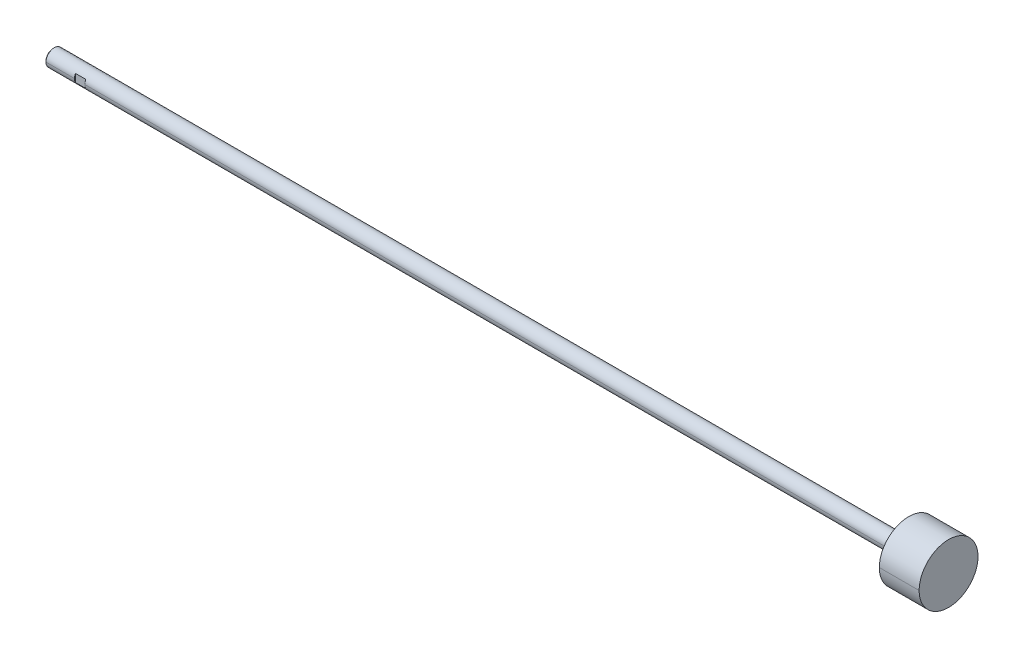
ISO-10303-21;
HEADER;
FILE_DESCRIPTION(('STEP AP214'),'2;1');
FILE_NAME('part.step','',(''),(''),'','','');
FILE_SCHEMA(('AUTOMOTIVE_DESIGN { 1 0 10303 214 1 1 1 1 }'));
ENDSEC;
DATA;
#1=APPLICATION_CONTEXT('core data for automotive mechanical design processes');
#2=APPLICATION_PROTOCOL_DEFINITION('international standard','automotive_design',2000,#1);
#3=PRODUCT_CONTEXT('',#1,'mechanical');
#4=PRODUCT('Part','Part','',(#3));
#5=PRODUCT_RELATED_PRODUCT_CATEGORY('part','',(#4));
#6=PRODUCT_DEFINITION_FORMATION('','',#4);
#7=PRODUCT_DEFINITION_CONTEXT('part definition',#1,'design');
#8=PRODUCT_DEFINITION('design','',#6,#7);
#9=PRODUCT_DEFINITION_SHAPE('','',#8);
#10=(LENGTH_UNIT() NAMED_UNIT(*) SI_UNIT(.MILLI.,.METRE.));
#11=(NAMED_UNIT(*) PLANE_ANGLE_UNIT() SI_UNIT($,.RADIAN.));
#12=(NAMED_UNIT(*) SI_UNIT($,.STERADIAN.) SOLID_ANGLE_UNIT());
#13=UNCERTAINTY_MEASURE_WITH_UNIT(LENGTH_MEASURE(1.E-05),#10,'distance_accuracy_value','');
#14=(GEOMETRIC_REPRESENTATION_CONTEXT(3) GLOBAL_UNCERTAINTY_ASSIGNED_CONTEXT((#13)) GLOBAL_UNIT_ASSIGNED_CONTEXT((#10,
#11,#12)) REPRESENTATION_CONTEXT('',''));
#15=CARTESIAN_POINT('',(0.,0.,0.));
#16=DIRECTION('',(0.,0.,1.));
#17=DIRECTION('',(1.,0.,0.));
#18=AXIS2_PLACEMENT_3D('',#15,#16,#17);
#19=CARTESIAN_POINT('',(0.,-6.35,-5.588));
#20=DIRECTION('',(0.,0.,1.));
#21=DIRECTION('',(1.,0.,0.));
#22=AXIS2_PLACEMENT_3D('',#19,#20,#21);
#23=PLANE('',#22);
#24=DIRECTION('',(0.,1.,0.));
#25=VECTOR('',#24,1.);
#26=CARTESIAN_POINT('',(-7.874,-6.35,-5.588));
#27=LINE('',#26,#25);
#28=CARTESIAN_POINT('',(-7.87400000000005,-3.01608289010763,-5.588));
#29=VERTEX_POINT('',#28);
#30=CARTESIAN_POINT('',(-7.87400000000005,3.01608289010763,-5.588));
#31=VERTEX_POINT('',#30);
#32=EDGE_CURVE('E11',#29,#31,#27,.T.);
#33=ORIENTED_EDGE('',*,*,#32,.T.);
#34=DIRECTION('',(1.,0.,0.));
#35=VECTOR('',#34,1.);
#36=CARTESIAN_POINT('',(649.351,3.01608289010763,-5.588));
#37=LINE('',#36,#35);
#38=CARTESIAN_POINT('',(0.,3.01608289010763,-5.588));
#39=VERTEX_POINT('',#38);
#40=EDGE_CURVE('E24',#31,#39,#37,.T.);
#41=ORIENTED_EDGE('',*,*,#40,.T.);
#42=DIRECTION('',(0.,1.,0.));
#43=VECTOR('',#42,1.);
#44=CARTESIAN_POINT('',(0.,-6.35,-5.588));
#45=LINE('',#44,#43);
#46=CARTESIAN_POINT('',(0.,-3.01608289010763,-5.588));
#47=VERTEX_POINT('',#46);
#48=EDGE_CURVE('E245',#47,#39,#45,.T.);
#49=ORIENTED_EDGE('',*,*,#48,.F.);
#50=DIRECTION('',(1.,0.,0.));
#51=VECTOR('',#50,1.);
#52=CARTESIAN_POINT('',(649.351,-3.01608289010763,-5.588));
#53=LINE('',#52,#51);
#54=EDGE_CURVE('E240',#29,#47,#53,.T.);
#55=ORIENTED_EDGE('',*,*,#54,.F.);
#56=EDGE_LOOP('',(#33,#41,#49,#55));
#57=FACE_BOUND('',#56,.T.);
#58=ADVANCED_FACE('F16',(#57),#23,.F.);
#59=CARTESIAN_POINT('',(649.351,0.,0.));
#60=DIRECTION('',(-1.,0.,0.));
#61=DIRECTION('',(0.,1.,0.));
#62=AXIS2_PLACEMENT_3D('',#59,#60,#61);
#63=CYLINDRICAL_SURFACE('',#62,6.35);
#64=CARTESIAN_POINT('',(-29.47035,0.,0.));
#65=DIRECTION('',(1.,0.,0.));
#66=DIRECTION('',(0.,0.,-1.));
#67=AXIS2_PLACEMENT_3D('',#64,#65,#66);
#68=CIRCLE('',#67,6.35);
#69=CARTESIAN_POINT('',(-29.4703500000001,0.,6.35));
#70=VERTEX_POINT('',#69);
#71=CARTESIAN_POINT('',(-29.47035,0.,-6.35));
#72=VERTEX_POINT('',#71);
#73=EDGE_CURVE('E236',#70,#72,#68,.T.);
#74=ORIENTED_EDGE('',*,*,#73,.T.);
#75=DIRECTION('',(-1.,0.,0.));
#76=VECTOR('',#75,1.);
#77=CARTESIAN_POINT('',(-7.87400000000002,0.,-6.35));
#78=LINE('',#77,#76);
#79=CARTESIAN_POINT('',(-7.87400000000002,0.,-6.35));
#80=VERTEX_POINT('',#79);
#81=EDGE_CURVE('E231',#80,#72,#78,.T.);
#82=ORIENTED_EDGE('',*,*,#81,.F.);
#83=CARTESIAN_POINT('',(-7.87400000000005,0.,0.));
#84=DIRECTION('',(1.,0.,0.));
#85=DIRECTION('',(0.,0.,-1.));
#86=AXIS2_PLACEMENT_3D('',#83,#84,#85);
#87=CIRCLE('',#86,6.35);
#88=EDGE_CURVE('E226',#29,#80,#87,.T.);
#89=ORIENTED_EDGE('',*,*,#88,.F.);
#90=ORIENTED_EDGE('',*,*,#54,.T.);
#91=CARTESIAN_POINT('',(0.,0.,0.));
#92=DIRECTION('',(1.,0.,0.));
#93=DIRECTION('',(0.,0.,-1.));
#94=AXIS2_PLACEMENT_3D('',#91,#92,#93);
#95=CIRCLE('',#94,6.35);
#96=CARTESIAN_POINT('',(0.,0.,-6.35));
#97=VERTEX_POINT('',#96);
#98=EDGE_CURVE('E222',#47,#97,#95,.T.);
#99=ORIENTED_EDGE('',*,*,#98,.T.);
#100=DIRECTION('',(-1.,0.,0.));
#101=VECTOR('',#100,1.);
#102=CARTESIAN_POINT('',(619.125,0.,-6.35));
#103=LINE('',#102,#101);
#104=CARTESIAN_POINT('',(619.125,0.,-6.35));
#105=VERTEX_POINT('',#104);
#106=EDGE_CURVE('E217',#105,#97,#103,.T.);
#107=ORIENTED_EDGE('',*,*,#106,.F.);
#108=CARTESIAN_POINT('',(619.125,0.,0.));
#109=DIRECTION('',(1.,0.,0.));
#110=DIRECTION('',(0.,0.,-1.));
#111=AXIS2_PLACEMENT_3D('',#108,#109,#110);
#112=CIRCLE('',#111,6.35);
#113=CARTESIAN_POINT('',(619.125,0.,6.35));
#114=VERTEX_POINT('',#113);
#115=EDGE_CURVE('E212',#114,#105,#112,.T.);
#116=ORIENTED_EDGE('',*,*,#115,.F.);
#117=DIRECTION('',(-1.,0.,0.));
#118=VECTOR('',#117,1.);
#119=CARTESIAN_POINT('',(619.125,0.,6.35));
#120=LINE('',#119,#118);
#121=CARTESIAN_POINT('',(0.,0.,6.35));
#122=VERTEX_POINT('',#121);
#123=EDGE_CURVE('E208',#114,#122,#120,.T.);
#124=ORIENTED_EDGE('',*,*,#123,.T.);
#125=CARTESIAN_POINT('',(0.,0.,0.));
#126=DIRECTION('',(1.,0.,0.));
#127=DIRECTION('',(0.,0.,-1.));
#128=AXIS2_PLACEMENT_3D('',#125,#126,#127);
#129=CIRCLE('',#128,6.35);
#130=CARTESIAN_POINT('',(0.,-3.01608289010763,5.588));
#131=VERTEX_POINT('',#130);
#132=EDGE_CURVE('E204',#122,#131,#129,.T.);
#133=ORIENTED_EDGE('',*,*,#132,.T.);
#134=DIRECTION('',(1.,0.,0.));
#135=VECTOR('',#134,1.);
#136=CARTESIAN_POINT('',(649.351,-3.01608289010763,5.588));
#137=LINE('',#136,#135);
#138=CARTESIAN_POINT('',(-7.87400000000005,-3.01608289010763,5.588));
#139=VERTEX_POINT('',#138);
#140=EDGE_CURVE('E199',#139,#131,#137,.T.);
#141=ORIENTED_EDGE('',*,*,#140,.F.);
#142=CARTESIAN_POINT('',(-7.87400000000005,0.,0.));
#143=DIRECTION('',(1.,0.,0.));
#144=DIRECTION('',(0.,0.,-1.));
#145=AXIS2_PLACEMENT_3D('',#142,#143,#144);
#146=CIRCLE('',#145,6.35);
#147=CARTESIAN_POINT('',(-7.87400000000002,0.,6.35));
#148=VERTEX_POINT('',#147);
#149=EDGE_CURVE('E194',#148,#139,#146,.T.);
#150=ORIENTED_EDGE('',*,*,#149,.F.);
#151=DIRECTION('',(-1.,0.,0.));
#152=VECTOR('',#151,1.);
#153=CARTESIAN_POINT('',(-7.87400000000002,0.,6.35));
#154=LINE('',#153,#152);
#155=EDGE_CURVE('E190',#148,#70,#154,.T.);
#156=ORIENTED_EDGE('',*,*,#155,.T.);
#157=EDGE_LOOP('',(#74,#82,#89,#90,#99,#107,#116,#124,#133,#141,#150,#156));
#158=FACE_BOUND('',#157,.T.);
#159=ADVANCED_FACE('F260',(#158),#63,.T.);
#160=CARTESIAN_POINT('',(649.351,0.,0.));
#161=DIRECTION('',(-1.,0.,0.));
#162=DIRECTION('',(0.,-1.,0.));
#163=AXIS2_PLACEMENT_3D('',#160,#161,#162);
#164=CYLINDRICAL_SURFACE('',#163,6.35);
#165=CARTESIAN_POINT('',(619.125,0.,0.));
#166=DIRECTION('',(1.,0.,0.));
#167=DIRECTION('',(0.,0.,-1.));
#168=AXIS2_PLACEMENT_3D('',#165,#166,#167);
#169=CIRCLE('',#168,6.35);
#170=EDGE_CURVE('E185',#105,#114,#169,.T.);
#171=ORIENTED_EDGE('',*,*,#170,.F.);
#172=ORIENTED_EDGE('',*,*,#106,.T.);
#173=CARTESIAN_POINT('',(0.,0.,0.));
#174=DIRECTION('',(1.,0.,0.));
#175=DIRECTION('',(0.,0.,-1.));
#176=AXIS2_PLACEMENT_3D('',#173,#174,#175);
#177=CIRCLE('',#176,6.35);
#178=EDGE_CURVE('E181',#97,#39,#177,.T.);
#179=ORIENTED_EDGE('',*,*,#178,.T.);
#180=ORIENTED_EDGE('',*,*,#40,.F.);
#181=CARTESIAN_POINT('',(-7.87400000000005,0.,0.));
#182=DIRECTION('',(1.,0.,0.));
#183=DIRECTION('',(0.,0.,-1.));
#184=AXIS2_PLACEMENT_3D('',#181,#182,#183);
#185=CIRCLE('',#184,6.35);
#186=EDGE_CURVE('E176',#80,#31,#185,.T.);
#187=ORIENTED_EDGE('',*,*,#186,.F.);
#188=ORIENTED_EDGE('',*,*,#81,.T.);
#189=CARTESIAN_POINT('',(-29.47035,0.,0.));
#190=DIRECTION('',(1.,0.,0.));
#191=DIRECTION('',(0.,0.,-1.));
#192=AXIS2_PLACEMENT_3D('',#189,#190,#191);
#193=CIRCLE('',#192,6.35);
#194=EDGE_CURVE('E171',#72,#70,#193,.T.);
#195=ORIENTED_EDGE('',*,*,#194,.T.);
#196=ORIENTED_EDGE('',*,*,#155,.F.);
#197=CARTESIAN_POINT('',(-7.87400000000005,0.,0.));
#198=DIRECTION('',(1.,0.,0.));
#199=DIRECTION('',(0.,0.,-1.));
#200=AXIS2_PLACEMENT_3D('',#197,#198,#199);
#201=CIRCLE('',#200,6.35);
#202=CARTESIAN_POINT('',(-7.87400000000005,3.01608289010763,5.588));
#203=VERTEX_POINT('',#202);
#204=EDGE_CURVE('E166',#203,#148,#201,.T.);
#205=ORIENTED_EDGE('',*,*,#204,.F.);
#206=DIRECTION('',(1.,0.,0.));
#207=VECTOR('',#206,1.);
#208=CARTESIAN_POINT('',(649.351,3.01608289010763,5.588));
#209=LINE('',#208,#207);
#210=CARTESIAN_POINT('',(0.,3.01608289010763,5.588));
#211=VERTEX_POINT('',#210);
#212=EDGE_CURVE('E162',#203,#211,#209,.T.);
#213=ORIENTED_EDGE('',*,*,#212,.T.);
#214=CARTESIAN_POINT('',(0.,0.,0.));
#215=DIRECTION('',(1.,0.,0.));
#216=DIRECTION('',(0.,0.,-1.));
#217=AXIS2_PLACEMENT_3D('',#214,#215,#216);
#218=CIRCLE('',#217,6.35);
#219=EDGE_CURVE('E157',#211,#122,#218,.T.);
#220=ORIENTED_EDGE('',*,*,#219,.T.);
#221=ORIENTED_EDGE('',*,*,#123,.F.);
#222=EDGE_LOOP('',(#171,#172,#179,#180,#187,#188,#195,#196,#205,#213,#220,#221));
#223=FACE_BOUND('',#222,.T.);
#224=ADVANCED_FACE('F266',(#223),#164,.T.);
#225=CARTESIAN_POINT('',(0.,0.,0.));
#226=DIRECTION('',(1.,0.,0.));
#227=DIRECTION('',(0.,0.,-1.));
#228=AXIS2_PLACEMENT_3D('',#225,#226,#227);
#229=PLANE('',#228);
#230=DIRECTION('',(0.,-1.,0.));
#231=VECTOR('',#230,1.);
#232=CARTESIAN_POINT('',(0.,6.35,5.588));
#233=LINE('',#232,#231);
#234=EDGE_CURVE('E152',#211,#131,#233,.T.);
#235=ORIENTED_EDGE('',*,*,#234,.T.);
#236=ORIENTED_EDGE('',*,*,#132,.F.);
#237=ORIENTED_EDGE('',*,*,#219,.F.);
#238=EDGE_LOOP('',(#235,#236,#237));
#239=FACE_BOUND('',#238,.T.);
#240=ADVANCED_FACE('F290',(#239),#229,.F.);
#241=CARTESIAN_POINT('',(0.,6.35,5.588));
#242=DIRECTION('',(0.,0.,-1.));
#243=DIRECTION('',(-1.,0.,0.));
#244=AXIS2_PLACEMENT_3D('',#241,#242,#243);
#245=PLANE('',#244);
#246=DIRECTION('',(0.,-1.,0.));
#247=VECTOR('',#246,1.);
#248=CARTESIAN_POINT('',(-7.874,6.35,5.588));
#249=LINE('',#248,#247);
#250=EDGE_CURVE('E147',#203,#139,#249,.T.);
#251=ORIENTED_EDGE('',*,*,#250,.T.);
#252=ORIENTED_EDGE('',*,*,#140,.T.);
#253=ORIENTED_EDGE('',*,*,#234,.F.);
#254=ORIENTED_EDGE('',*,*,#212,.F.);
#255=EDGE_LOOP('',(#251,#252,#253,#254));
#256=FACE_BOUND('',#255,.T.);
#257=ADVANCED_FACE('F295',(#256),#245,.F.);
#258=CARTESIAN_POINT('',(-7.874,0.,0.));
#259=DIRECTION('',(1.,0.,0.));
#260=DIRECTION('',(0.,0.,-1.));
#261=AXIS2_PLACEMENT_3D('',#258,#259,#260);
#262=PLANE('',#261);
#263=ORIENTED_EDGE('',*,*,#204,.T.);
#264=ORIENTED_EDGE('',*,*,#149,.T.);
#265=ORIENTED_EDGE('',*,*,#250,.F.);
#266=EDGE_LOOP('',(#263,#264,#265));
#267=FACE_BOUND('',#266,.T.);
#268=ADVANCED_FACE('F299',(#267),#262,.T.);
#269=CARTESIAN_POINT('',(-30.226,0.,0.));
#270=DIRECTION('',(1.,0.,0.));
#271=DIRECTION('',(0.,-1.,0.));
#272=AXIS2_PLACEMENT_3D('',#269,#270,#271);
#273=CONICAL_SURFACE('',#272,5.59435,0.7853981634);
#274=ORIENTED_EDGE('',*,*,#194,.F.);
#275=DIRECTION('',(0.707106781184744,0.,-0.707106781188351));
#276=VECTOR('',#275,1.);
#277=CARTESIAN_POINT('',(-30.226,0.,-5.59435));
#278=LINE('',#277,#276);
#279=CARTESIAN_POINT('',(-30.226,0.,-5.59435));
#280=VERTEX_POINT('',#279);
#281=EDGE_CURVE('E142',#280,#72,#278,.T.);
#282=ORIENTED_EDGE('',*,*,#281,.F.);
#283=CARTESIAN_POINT('',(-30.226,0.,0.));
#284=DIRECTION('',(1.,0.,0.));
#285=DIRECTION('',(0.,0.,-1.));
#286=AXIS2_PLACEMENT_3D('',#283,#284,#285);
#287=CIRCLE('',#286,5.59435);
#288=CARTESIAN_POINT('',(-30.226,0.,5.59435));
#289=VERTEX_POINT('',#288);
#290=EDGE_CURVE('E138',#280,#289,#287,.T.);
#291=ORIENTED_EDGE('',*,*,#290,.T.);
#292=DIRECTION('',(0.707106781184744,0.,0.707106781188351));
#293=VECTOR('',#292,1.);
#294=CARTESIAN_POINT('',(-30.226,0.,5.59435));
#295=LINE('',#294,#293);
#296=EDGE_CURVE('E133',#289,#70,#295,.T.);
#297=ORIENTED_EDGE('',*,*,#296,.T.);
#298=EDGE_LOOP('',(#274,#282,#291,#297));
#299=FACE_BOUND('',#298,.T.);
#300=ADVANCED_FACE('F303',(#299),#273,.T.);
#301=CARTESIAN_POINT('',(-30.226,0.,0.));
#302=DIRECTION('',(1.,0.,0.));
#303=DIRECTION('',(0.,1.,0.));
#304=AXIS2_PLACEMENT_3D('',#301,#302,#303);
#305=CONICAL_SURFACE('',#304,5.59435,0.7853981634);
#306=CARTESIAN_POINT('',(-30.226,0.,0.));
#307=DIRECTION('',(1.,0.,0.));
#308=DIRECTION('',(0.,0.,-1.));
#309=AXIS2_PLACEMENT_3D('',#306,#307,#308);
#310=CIRCLE('',#309,5.59435);
#311=EDGE_CURVE('E128',#289,#280,#310,.T.);
#312=ORIENTED_EDGE('',*,*,#311,.T.);
#313=ORIENTED_EDGE('',*,*,#281,.T.);
#314=ORIENTED_EDGE('',*,*,#73,.F.);
#315=ORIENTED_EDGE('',*,*,#296,.F.);
#316=EDGE_LOOP('',(#312,#313,#314,#315));
#317=FACE_BOUND('',#316,.T.);
#318=ADVANCED_FACE('F307',(#317),#305,.T.);
#319=CARTESIAN_POINT('',(-30.226,0.,0.));
#320=DIRECTION('',(1.,0.,0.));
#321=DIRECTION('',(0.,0.,-1.));
#322=AXIS2_PLACEMENT_3D('',#319,#320,#321);
#323=PLANE('',#322);
#324=ORIENTED_EDGE('',*,*,#290,.F.);
#325=ORIENTED_EDGE('',*,*,#311,.F.);
#326=EDGE_LOOP('',(#324,#325));
#327=FACE_BOUND('',#326,.T.);
#328=ADVANCED_FACE('F311',(#327),#323,.F.);
#329=CARTESIAN_POINT('',(-7.874,0.,0.));
#330=DIRECTION('',(1.,0.,0.));
#331=DIRECTION('',(0.,0.,-1.));
#332=AXIS2_PLACEMENT_3D('',#329,#330,#331);
#333=PLANE('',#332);
#334=ORIENTED_EDGE('',*,*,#88,.T.);
#335=ORIENTED_EDGE('',*,*,#186,.T.);
#336=ORIENTED_EDGE('',*,*,#32,.F.);
#337=EDGE_LOOP('',(#334,#335,#336));
#338=FACE_BOUND('',#337,.T.);
#339=ADVANCED_FACE('F263',(#338),#333,.T.);
#340=CARTESIAN_POINT('',(0.,0.,0.));
#341=DIRECTION('',(1.,0.,0.));
#342=DIRECTION('',(0.,0.,-1.));
#343=AXIS2_PLACEMENT_3D('',#340,#341,#342);
#344=PLANE('',#343);
#345=ORIENTED_EDGE('',*,*,#48,.T.);
#346=ORIENTED_EDGE('',*,*,#178,.F.);
#347=ORIENTED_EDGE('',*,*,#98,.F.);
#348=EDGE_LOOP('',(#345,#346,#347));
#349=FACE_BOUND('',#348,.T.);
#350=ADVANCED_FACE('F257',(#349),#344,.F.);
#351=CARTESIAN_POINT('',(619.125,6.35,0.));
#352=DIRECTION('',(1.,0.,0.));
#353=DIRECTION('',(0.,0.,-1.));
#354=AXIS2_PLACEMENT_3D('',#351,#352,#353);
#355=PLANE('',#354);
#356=CARTESIAN_POINT('',(619.125,0.,0.));
#357=DIRECTION('',(1.,0.,0.));
#358=DIRECTION('',(0.,0.,-1.));
#359=AXIS2_PLACEMENT_3D('',#356,#357,#358);
#360=CIRCLE('',#359,22.34565);
#361=CARTESIAN_POINT('',(619.125,0.,-22.34565));
#362=VERTEX_POINT('',#361);
#363=CARTESIAN_POINT('',(619.125,0.,22.34565));
#364=VERTEX_POINT('',#363);
#365=EDGE_CURVE('E109',#362,#364,#360,.T.);
#366=ORIENTED_EDGE('',*,*,#365,.F.);
#367=CARTESIAN_POINT('',(619.125,0.,0.));
#368=DIRECTION('',(1.,0.,0.));
#369=DIRECTION('',(0.,0.,-1.));
#370=AXIS2_PLACEMENT_3D('',#367,#368,#369);
#371=CIRCLE('',#370,22.34565);
#372=EDGE_CURVE('E121',#364,#362,#371,.T.);
#373=ORIENTED_EDGE('',*,*,#372,.F.);
#374=EDGE_LOOP('',(#366,#373));
#375=FACE_BOUND('',#374,.T.);
#376=ORIENTED_EDGE('',*,*,#170,.T.);
#377=ORIENTED_EDGE('',*,*,#115,.T.);
#378=EDGE_LOOP('',(#376,#377));
#379=FACE_BOUND('',#378,.T.);
#380=ADVANCED_FACE('F272',(#375,#379),#355,.F.);
#381=CARTESIAN_POINT('',(649.351,0.,0.));
#382=DIRECTION('',(-1.,0.,0.));
#383=DIRECTION('',(0.,1.,0.));
#384=AXIS2_PLACEMENT_3D('',#381,#382,#383);
#385=CYLINDRICAL_SURFACE('',#384,22.34565);
#386=ORIENTED_EDGE('',*,*,#372,.T.);
#387=DIRECTION('',(-1.,0.,0.));
#388=VECTOR('',#387,1.);
#389=CARTESIAN_POINT('',(649.351,0.,-22.34565));
#390=LINE('',#389,#388);
#391=CARTESIAN_POINT('',(649.351,0.,-22.34565));
#392=VERTEX_POINT('',#391);
#393=EDGE_CURVE('E101',#392,#362,#390,.T.);
#394=ORIENTED_EDGE('',*,*,#393,.F.);
#395=CARTESIAN_POINT('',(649.351,0.,0.));
#396=DIRECTION('',(1.,0.,0.));
#397=DIRECTION('',(0.,0.,-1.));
#398=AXIS2_PLACEMENT_3D('',#395,#396,#397);
#399=CIRCLE('',#398,22.34565);
#400=CARTESIAN_POINT('',(649.351,0.,22.34565));
#401=VERTEX_POINT('',#400);
#402=EDGE_CURVE('E94',#401,#392,#399,.T.);
#403=ORIENTED_EDGE('',*,*,#402,.F.);
#404=DIRECTION('',(-1.,0.,0.));
#405=VECTOR('',#404,1.);
#406=CARTESIAN_POINT('',(649.351,0.,22.34565));
#407=LINE('',#406,#405);
#408=EDGE_CURVE('E98',#401,#364,#407,.T.);
#409=ORIENTED_EDGE('',*,*,#408,.T.);
#410=EDGE_LOOP('',(#386,#394,#403,#409));
#411=FACE_BOUND('',#410,.T.);
#412=ADVANCED_FACE('F97',(#411),#385,.T.);
#413=CARTESIAN_POINT('',(649.351,0.,0.));
#414=DIRECTION('',(-1.,0.,0.));
#415=DIRECTION('',(0.,-1.,0.));
#416=AXIS2_PLACEMENT_3D('',#413,#414,#415);
#417=CYLINDRICAL_SURFACE('',#416,22.34565);
#418=CARTESIAN_POINT('',(649.351,0.,0.));
#419=DIRECTION('',(1.,0.,0.));
#420=DIRECTION('',(0.,0.,-1.));
#421=AXIS2_PLACEMENT_3D('',#418,#419,#420);
#422=CIRCLE('',#421,22.34565);
#423=EDGE_CURVE('E108',#392,#401,#422,.T.);
#424=ORIENTED_EDGE('',*,*,#423,.F.);
#425=ORIENTED_EDGE('',*,*,#393,.T.);
#426=ORIENTED_EDGE('',*,*,#365,.T.);
#427=ORIENTED_EDGE('',*,*,#408,.F.);
#428=EDGE_LOOP('',(#424,#425,#426,#427));
#429=FACE_BOUND('',#428,.T.);
#430=ADVANCED_FACE('F107',(#429),#417,.T.);
#431=CARTESIAN_POINT('',(649.351,22.34565,0.));
#432=DIRECTION('',(-1.,0.,0.));
#433=DIRECTION('',(0.,0.,1.));
#434=AXIS2_PLACEMENT_3D('',#431,#432,#433);
#435=PLANE('',#434);
#436=ORIENTED_EDGE('',*,*,#423,.T.);
#437=ORIENTED_EDGE('',*,*,#402,.T.);
#438=EDGE_LOOP('',(#436,#437));
#439=FACE_BOUND('',#438,.T.);
#440=ADVANCED_FACE('F111',(#439),#435,.F.);
#441=CLOSED_SHELL('',(#58,#159,#224,#240,#257,#268,#300,#318,#328,#339,#350,#380,#412,#430,#440));
#442=MANIFOLD_SOLID_BREP('B1',#441);
#443=ADVANCED_BREP_SHAPE_REPRESENTATION('',(#18,#442),#14);
#444=SHAPE_DEFINITION_REPRESENTATION(#9,#443);
ENDSEC;
END-ISO-10303-21;
